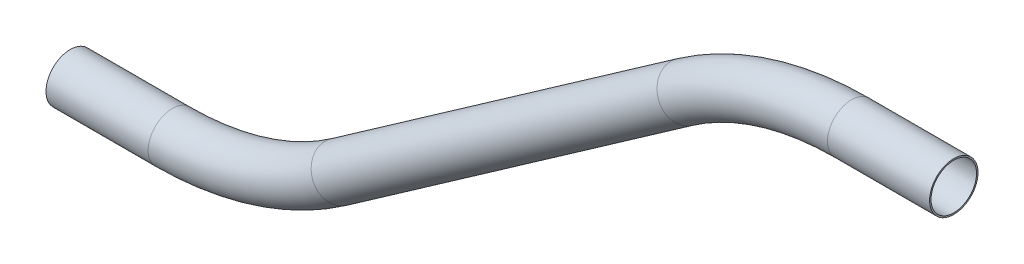
ISO-10303-21;
HEADER;
FILE_DESCRIPTION(('STEP AP214'),'2;1');
FILE_NAME('part.step','',(''),(''),'','','');
FILE_SCHEMA(('AUTOMOTIVE_DESIGN { 1 0 10303 214 1 1 1 1 }'));
ENDSEC;
DATA;
#1=APPLICATION_CONTEXT('core data for automotive mechanical design processes');
#2=APPLICATION_PROTOCOL_DEFINITION('international standard','automotive_design',2000,#1);
#3=PRODUCT_CONTEXT('',#1,'mechanical');
#4=PRODUCT('Part','Part','',(#3));
#5=PRODUCT_RELATED_PRODUCT_CATEGORY('part','',(#4));
#6=PRODUCT_DEFINITION_FORMATION('','',#4);
#7=PRODUCT_DEFINITION_CONTEXT('part definition',#1,'design');
#8=PRODUCT_DEFINITION('design','',#6,#7);
#9=PRODUCT_DEFINITION_SHAPE('','',#8);
#10=(LENGTH_UNIT() NAMED_UNIT(*) SI_UNIT(.MILLI.,.METRE.));
#11=(NAMED_UNIT(*) PLANE_ANGLE_UNIT() SI_UNIT($,.RADIAN.));
#12=(NAMED_UNIT(*) SI_UNIT($,.STERADIAN.) SOLID_ANGLE_UNIT());
#13=UNCERTAINTY_MEASURE_WITH_UNIT(LENGTH_MEASURE(1.E-05),#10,'distance_accuracy_value','');
#14=(GEOMETRIC_REPRESENTATION_CONTEXT(3) GLOBAL_UNCERTAINTY_ASSIGNED_CONTEXT((#13)) GLOBAL_UNIT_ASSIGNED_CONTEXT((#10,
#11,#12)) REPRESENTATION_CONTEXT('',''));
#15=CARTESIAN_POINT('',(0.,0.,0.));
#16=DIRECTION('',(0.,0.,1.));
#17=DIRECTION('',(1.,0.,0.));
#18=AXIS2_PLACEMENT_3D('',#15,#16,#17);
#19=CARTESIAN_POINT('',(127.067542117293,51.0747369569716,0.));
#20=DIRECTION('',(-1.,0.,0.));
#21=DIRECTION('',(0.,-1.,0.));
#22=AXIS2_PLACEMENT_3D('',#19,#20,#21);
#23=CYLINDRICAL_SURFACE('',#22,6.35);
#24=CARTESIAN_POINT('',(100.293309829871,51.0747369569716,0.));
#25=DIRECTION('',(-1.,0.,0.));
#26=DIRECTION('',(0.,-1.,0.));
#27=AXIS2_PLACEMENT_3D('',#24,#25,#26);
#28=CIRCLE('',#27,6.35);
#29=CARTESIAN_POINT('',(100.293309829871,57.4247369569716,0.));
#30=VERTEX_POINT('',#29);
#31=EDGE_CURVE('E55',#30,#30,#28,.T.);
#32=ORIENTED_EDGE('',*,*,#31,.F.);
#33=EDGE_LOOP('',(#32));
#34=FACE_BOUND('',#33,.T.);
#35=CARTESIAN_POINT('',(127.067542117293,51.0747369569716,0.));
#36=DIRECTION('',(-1.,0.,0.));
#37=DIRECTION('',(0.,-1.,0.));
#38=AXIS2_PLACEMENT_3D('',#35,#36,#37);
#39=CIRCLE('',#38,6.35);
#40=CARTESIAN_POINT('',(127.067542117293,44.7247369569716,0.));
#41=VERTEX_POINT('',#40);
#42=EDGE_CURVE('E52',#41,#41,#39,.T.);
#43=ORIENTED_EDGE('',*,*,#42,.T.);
#44=EDGE_LOOP('',(#43));
#45=FACE_BOUND('',#44,.T.);
#46=ADVANCED_FACE('F31',(#34,#45),#23,.T.);
#47=CARTESIAN_POINT('',(100.293309829871,-25.1252630430284,0.));
#48=DIRECTION('',(0.,0.,1.));
#49=DIRECTION('',(1.,0.,0.));
#50=AXIS2_PLACEMENT_3D('',#47,#48,#49);
#51=TOROIDAL_SURFACE('',#50,76.2000000000001,6.35);
#52=CARTESIAN_POINT('',(56.5867853799217,37.2941227317927,0.));
#53=DIRECTION('',(-0.819152044288991,-0.573576436351047,0.));
#54=DIRECTION('',(0.573576436351047,-0.819152044288991,0.));
#55=AXIS2_PLACEMENT_3D('',#52,#53,#54);
#56=CIRCLE('',#55,6.35);
#57=CARTESIAN_POINT('',(52.9445750090925,42.4957382130278,0.));
#58=VERTEX_POINT('',#57);
#59=EDGE_CURVE('E58',#58,#58,#56,.T.);
#60=CARTESIAN_POINT('',(100.293309829871,-25.1252630430284,0.));
#61=DIRECTION('',(0.,0.,1.));
#62=DIRECTION('',(1.,0.,0.));
#63=AXIS2_PLACEMENT_3D('',#60,#61,#62);
#64=CIRCLE('',#63,82.5500000000001);
#65=EDGE_CURVE('',#30,#58,#64,.T.);
#66=ORIENTED_EDGE('',*,*,#31,.T.);
#67=ORIENTED_EDGE('',*,*,#59,.F.);
#68=ORIENTED_EDGE('',*,*,#65,.T.);
#69=ORIENTED_EDGE('',*,*,#65,.F.);
#70=EDGE_LOOP('',(#66,#68,#67,#69));
#71=FACE_BOUND('',#70,.T.);
#72=ADVANCED_FACE('F77',(#71),#51,.T.);
#73=CARTESIAN_POINT('',(56.5867853799216,37.2941227317927,0.));
#74=DIRECTION('',(-0.819152044288991,-0.573576436351048,0.));
#75=DIRECTION('',(0.573576436351048,-0.819152044288991,0.));
#76=AXIS2_PLACEMENT_3D('',#73,#74,#75);
#77=CYLINDRICAL_SURFACE('',#76,6.35);
#78=CARTESIAN_POINT('',(-34.0920881762132,-26.1999080885784,0.));
#79=DIRECTION('',(-0.819152044288991,-0.573576436351047,0.));
#80=DIRECTION('',(0.573576436351047,-0.819152044288991,0.));
#81=AXIS2_PLACEMENT_3D('',#78,#79,#80);
#82=CIRCLE('',#81,6.35);
#83=CARTESIAN_POINT('',(-30.4498778053841,-31.4015235698134,0.));
#84=VERTEX_POINT('',#83);
#85=EDGE_CURVE('E60',#84,#84,#82,.T.);
#86=ORIENTED_EDGE('',*,*,#85,.F.);
#87=EDGE_LOOP('',(#86));
#88=FACE_BOUND('',#87,.T.);
#89=ORIENTED_EDGE('',*,*,#59,.T.);
#90=EDGE_LOOP('',(#89));
#91=FACE_BOUND('',#90,.T.);
#92=ADVANCED_FACE('F70',(#88,#91),#77,.T.);
#93=CARTESIAN_POINT('',(-77.7986126261631,36.2194776862428,0.));
#94=DIRECTION('',(0.,0.,-1.));
#95=DIRECTION('',(-1.,0.,0.));
#96=AXIS2_PLACEMENT_3D('',#93,#94,#95);
#97=TOROIDAL_SURFACE('',#96,76.2,6.35);
#98=CARTESIAN_POINT('',(-77.7986126261629,-39.9805223137573,0.));
#99=DIRECTION('',(-1.,0.,0.));
#100=DIRECTION('',(0.,-1.,0.));
#101=AXIS2_PLACEMENT_3D('',#98,#99,#100);
#102=CIRCLE('',#101,6.35);
#103=CARTESIAN_POINT('',(-77.7986126261629,-46.3305223137573,0.));
#104=VERTEX_POINT('',#103);
#105=EDGE_CURVE('E35',#104,#104,#102,.T.);
#106=CARTESIAN_POINT('',(-77.7986126261631,36.2194776862428,0.));
#107=DIRECTION('',(0.,0.,-1.));
#108=DIRECTION('',(-1.,0.,0.));
#109=AXIS2_PLACEMENT_3D('',#106,#107,#108);
#110=CIRCLE('',#109,82.55);
#111=EDGE_CURVE('',#84,#104,#110,.T.);
#112=ORIENTED_EDGE('',*,*,#85,.T.);
#113=ORIENTED_EDGE('',*,*,#105,.F.);
#114=ORIENTED_EDGE('',*,*,#111,.T.);
#115=ORIENTED_EDGE('',*,*,#111,.F.);
#116=EDGE_LOOP('',(#112,#114,#113,#115));
#117=FACE_BOUND('',#116,.T.);
#118=ADVANCED_FACE('F68',(#117),#97,.T.);
#119=CARTESIAN_POINT('',(-77.798612626163,-39.9805223137573,0.));
#120=DIRECTION('',(-1.,0.,0.));
#121=DIRECTION('',(0.,-1.,0.));
#122=AXIS2_PLACEMENT_3D('',#119,#120,#121);
#123=CYLINDRICAL_SURFACE('',#122,6.35);
#124=CARTESIAN_POINT('',(-104.572844913584,-39.9805223137573,0.));
#125=DIRECTION('',(-1.,0.,0.));
#126=DIRECTION('',(0.,-1.,0.));
#127=AXIS2_PLACEMENT_3D('',#124,#125,#126);
#128=CIRCLE('',#127,6.35);
#129=CARTESIAN_POINT('',(-104.572844913584,-46.3305223137573,0.));
#130=VERTEX_POINT('',#129);
#131=EDGE_CURVE('E48',#130,#130,#128,.T.);
#132=ORIENTED_EDGE('',*,*,#131,.F.);
#133=EDGE_LOOP('',(#132));
#134=FACE_BOUND('',#133,.T.);
#135=ORIENTED_EDGE('',*,*,#105,.T.);
#136=EDGE_LOOP('',(#135));
#137=FACE_BOUND('',#136,.T.);
#138=ADVANCED_FACE('F33',(#134,#137),#123,.T.);
#139=CARTESIAN_POINT('',(127.067542117293,51.0747369569716,0.));
#140=DIRECTION('',(-1.,0.,0.));
#141=DIRECTION('',(0.,-1.,0.));
#142=AXIS2_PLACEMENT_3D('',#139,#140,#141);
#143=PLANE('',#142);
#144=CARTESIAN_POINT('',(127.067542117293,51.0747369569716,0.));
#145=DIRECTION('',(-1.,0.,0.));
#146=DIRECTION('',(0.,-1.,0.));
#147=AXIS2_PLACEMENT_3D('',#144,#145,#146);
#148=CIRCLE('',#147,5.969);
#149=CARTESIAN_POINT('',(127.067542117293,45.1057369569716,0.));
#150=VERTEX_POINT('',#149);
#151=EDGE_CURVE('E51',#150,#150,#148,.F.);
#152=ORIENTED_EDGE('',*,*,#151,.F.);
#153=EDGE_LOOP('',(#152));
#154=FACE_BOUND('',#153,.T.);
#155=ORIENTED_EDGE('',*,*,#42,.F.);
#156=EDGE_LOOP('',(#155));
#157=FACE_BOUND('',#156,.T.);
#158=ADVANCED_FACE('F75',(#154,#157),#143,.F.);
#159=CARTESIAN_POINT('',(-104.572844913584,-39.9805223137573,0.));
#160=DIRECTION('',(-1.,0.,0.));
#161=DIRECTION('',(0.,-1.,0.));
#162=AXIS2_PLACEMENT_3D('',#159,#160,#161);
#163=PLANE('',#162);
#164=CARTESIAN_POINT('',(-104.572844913584,-39.9805223137573,0.));
#165=DIRECTION('',(-1.,0.,0.));
#166=DIRECTION('',(0.,-1.,0.));
#167=AXIS2_PLACEMENT_3D('',#164,#165,#166);
#168=CIRCLE('',#167,5.969);
#169=CARTESIAN_POINT('',(-104.572844913584,-45.9495223137573,0.));
#170=VERTEX_POINT('',#169);
#171=EDGE_CURVE('E10',#170,#170,#168,.F.);
#172=ORIENTED_EDGE('',*,*,#171,.T.);
#173=EDGE_LOOP('',(#172));
#174=FACE_BOUND('',#173,.T.);
#175=ORIENTED_EDGE('',*,*,#131,.T.);
#176=EDGE_LOOP('',(#175));
#177=FACE_BOUND('',#176,.T.);
#178=ADVANCED_FACE('F94',(#174,#177),#163,.T.);
#179=CARTESIAN_POINT('',(127.067542117293,51.0747369569716,0.));
#180=DIRECTION('',(-1.,0.,0.));
#181=DIRECTION('',(0.,-1.,0.));
#182=AXIS2_PLACEMENT_3D('',#179,#180,#181);
#183=CYLINDRICAL_SURFACE('',#182,5.969);
#184=CARTESIAN_POINT('',(100.293309829871,51.0747369569716,0.));
#185=DIRECTION('',(-1.,0.,0.));
#186=DIRECTION('',(0.,-1.,0.));
#187=AXIS2_PLACEMENT_3D('',#184,#185,#186);
#188=CIRCLE('',#187,5.969);
#189=CARTESIAN_POINT('',(100.293309829871,57.0437369569716,0.));
#190=VERTEX_POINT('',#189);
#191=EDGE_CURVE('E190',#190,#190,#188,.F.);
#192=ORIENTED_EDGE('',*,*,#191,.F.);
#193=EDGE_LOOP('',(#192));
#194=FACE_BOUND('',#193,.T.);
#195=ORIENTED_EDGE('',*,*,#151,.T.);
#196=EDGE_LOOP('',(#195));
#197=FACE_BOUND('',#196,.T.);
#198=ADVANCED_FACE('F97',(#194,#197),#183,.F.);
#199=CARTESIAN_POINT('',(100.293309829871,-25.1252630430284,0.));
#200=DIRECTION('',(0.,0.,1.));
#201=DIRECTION('',(1.,0.,0.));
#202=AXIS2_PLACEMENT_3D('',#199,#200,#201);
#203=TOROIDAL_SURFACE('',#202,76.2000000000001,5.969);
#204=CARTESIAN_POINT('',(56.5867853799217,37.2941227317927,0.));
#205=DIRECTION('',(-0.819152044288991,-0.573576436351047,0.));
#206=DIRECTION('',(0.573576436351047,-0.819152044288991,0.));
#207=AXIS2_PLACEMENT_3D('',#204,#205,#206);
#208=CIRCLE('',#207,5.969);
#209=CARTESIAN_POINT('',(53.1631076313422,42.1836412841537,0.));
#210=VERTEX_POINT('',#209);
#211=EDGE_CURVE('E189',#210,#210,#208,.F.);
#212=CARTESIAN_POINT('',(100.293309829871,-25.1252630430284,0.));
#213=DIRECTION('',(0.,0.,1.));
#214=DIRECTION('',(1.,0.,0.));
#215=AXIS2_PLACEMENT_3D('',#212,#213,#214);
#216=CIRCLE('',#215,82.1690000000001);
#217=EDGE_CURVE('',#190,#210,#216,.T.);
#218=ORIENTED_EDGE('',*,*,#191,.T.);
#219=ORIENTED_EDGE('',*,*,#211,.F.);
#220=ORIENTED_EDGE('',*,*,#217,.T.);
#221=ORIENTED_EDGE('',*,*,#217,.F.);
#222=EDGE_LOOP('',(#218,#220,#219,#221));
#223=FACE_BOUND('',#222,.T.);
#224=ADVANCED_FACE('F152',(#223),#203,.F.);
#225=CARTESIAN_POINT('',(56.5867853799216,37.2941227317927,0.));
#226=DIRECTION('',(-0.819152044288991,-0.573576436351048,0.));
#227=DIRECTION('',(0.573576436351048,-0.819152044288991,0.));
#228=AXIS2_PLACEMENT_3D('',#225,#226,#227);
#229=CYLINDRICAL_SURFACE('',#228,5.969);
#230=CARTESIAN_POINT('',(-34.0920881762132,-26.1999080885784,0.));
#231=DIRECTION('',(-0.819152044288991,-0.573576436351047,0.));
#232=DIRECTION('',(0.573576436351047,-0.819152044288991,0.));
#233=AXIS2_PLACEMENT_3D('',#230,#231,#232);
#234=CIRCLE('',#233,5.969);
#235=CARTESIAN_POINT('',(-30.6684104276338,-31.0894266409393,0.));
#236=VERTEX_POINT('',#235);
#237=EDGE_CURVE('E44',#236,#236,#234,.F.);
#238=ORIENTED_EDGE('',*,*,#237,.F.);
#239=EDGE_LOOP('',(#238));
#240=FACE_BOUND('',#239,.T.);
#241=ORIENTED_EDGE('',*,*,#211,.T.);
#242=EDGE_LOOP('',(#241));
#243=FACE_BOUND('',#242,.T.);
#244=ADVANCED_FACE('F88',(#240,#243),#229,.F.);
#245=CARTESIAN_POINT('',(-77.7986126261631,36.2194776862428,0.));
#246=DIRECTION('',(0.,0.,-1.));
#247=DIRECTION('',(-1.,0.,0.));
#248=AXIS2_PLACEMENT_3D('',#245,#246,#247);
#249=TOROIDAL_SURFACE('',#248,76.2,5.969);
#250=CARTESIAN_POINT('',(-77.7986126261629,-39.9805223137573,0.));
#251=DIRECTION('',(-1.,0.,0.));
#252=DIRECTION('',(0.,-1.,0.));
#253=AXIS2_PLACEMENT_3D('',#250,#251,#252);
#254=CIRCLE('',#253,5.969);
#255=CARTESIAN_POINT('',(-77.7986126261629,-45.9495223137573,0.));
#256=VERTEX_POINT('',#255);
#257=EDGE_CURVE('E39',#256,#256,#254,.F.);
#258=CARTESIAN_POINT('',(-77.7986126261631,36.2194776862428,0.));
#259=DIRECTION('',(0.,0.,-1.));
#260=DIRECTION('',(-1.,0.,0.));
#261=AXIS2_PLACEMENT_3D('',#258,#259,#260);
#262=CIRCLE('',#261,82.1690000000001);
#263=EDGE_CURVE('',#236,#256,#262,.T.);
#264=ORIENTED_EDGE('',*,*,#237,.T.);
#265=ORIENTED_EDGE('',*,*,#257,.F.);
#266=ORIENTED_EDGE('',*,*,#263,.T.);
#267=ORIENTED_EDGE('',*,*,#263,.F.);
#268=EDGE_LOOP('',(#264,#266,#265,#267));
#269=FACE_BOUND('',#268,.T.);
#270=ADVANCED_FACE('F82',(#269),#249,.F.);
#271=CARTESIAN_POINT('',(-77.798612626163,-39.9805223137573,0.));
#272=DIRECTION('',(-1.,0.,0.));
#273=DIRECTION('',(0.,-1.,0.));
#274=AXIS2_PLACEMENT_3D('',#271,#272,#273);
#275=CYLINDRICAL_SURFACE('',#274,5.969);
#276=ORIENTED_EDGE('',*,*,#171,.F.);
#277=EDGE_LOOP('',(#276));
#278=FACE_BOUND('',#277,.T.);
#279=ORIENTED_EDGE('',*,*,#257,.T.);
#280=EDGE_LOOP('',(#279));
#281=FACE_BOUND('',#280,.T.);
#282=ADVANCED_FACE('F80',(#278,#281),#275,.F.);
#283=CLOSED_SHELL('',(#46,#72,#92,#118,#138,#158,#178,#198,#224,#244,#270,#282));
#284=MANIFOLD_SOLID_BREP('B2',#283);
#285=ADVANCED_BREP_SHAPE_REPRESENTATION('',(#18,#284),#14);
#286=SHAPE_DEFINITION_REPRESENTATION(#9,#285);
ENDSEC;
END-ISO-10303-21;
